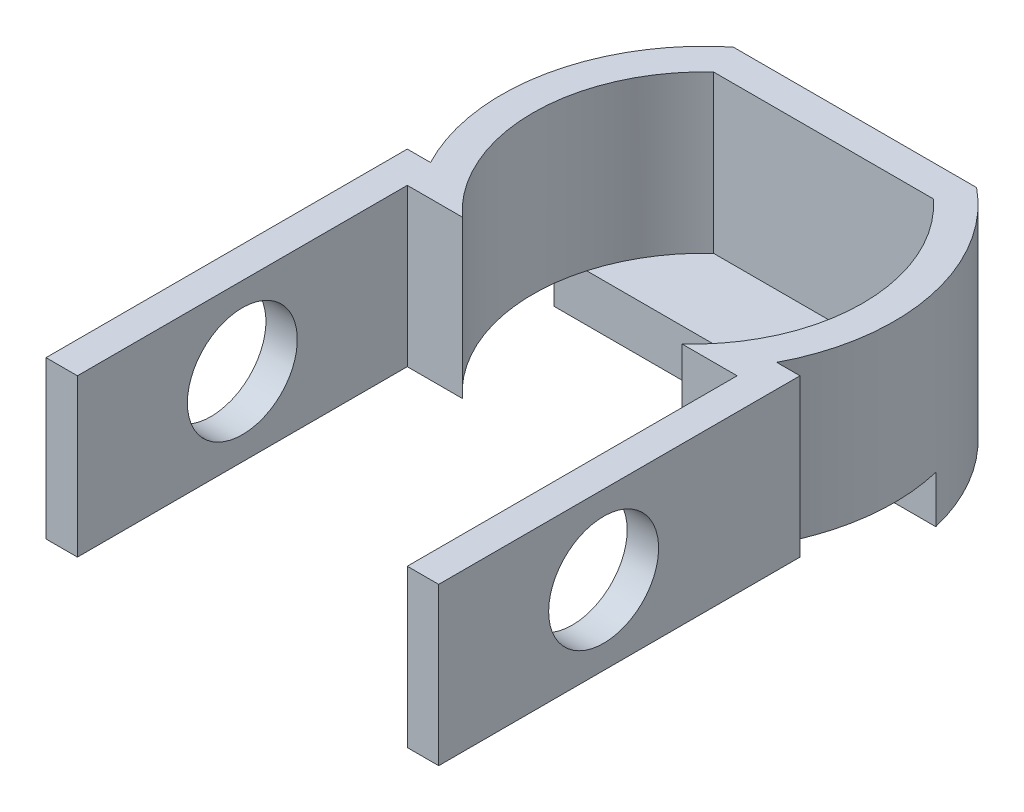
ISO-10303-21;
HEADER;
FILE_DESCRIPTION(('STEP AP214'),'2;1');
FILE_NAME('part.step','',(''),(''),'','','');
FILE_SCHEMA(('AUTOMOTIVE_DESIGN { 1 0 10303 214 1 1 1 1 }'));
ENDSEC;
DATA;
#1=APPLICATION_CONTEXT('core data for automotive mechanical design processes');
#2=APPLICATION_PROTOCOL_DEFINITION('international standard','automotive_design',2000,#1);
#3=PRODUCT_CONTEXT('',#1,'mechanical');
#4=PRODUCT('Part','Part','',(#3));
#5=PRODUCT_RELATED_PRODUCT_CATEGORY('part','',(#4));
#6=PRODUCT_DEFINITION_FORMATION('','',#4);
#7=PRODUCT_DEFINITION_CONTEXT('part definition',#1,'design');
#8=PRODUCT_DEFINITION('design','',#6,#7);
#9=PRODUCT_DEFINITION_SHAPE('','',#8);
#10=(LENGTH_UNIT() NAMED_UNIT(*) SI_UNIT(.MILLI.,.METRE.));
#11=(NAMED_UNIT(*) PLANE_ANGLE_UNIT() SI_UNIT($,.RADIAN.));
#12=(NAMED_UNIT(*) SI_UNIT($,.STERADIAN.) SOLID_ANGLE_UNIT());
#13=UNCERTAINTY_MEASURE_WITH_UNIT(LENGTH_MEASURE(1.E-05),#10,'distance_accuracy_value','');
#14=(GEOMETRIC_REPRESENTATION_CONTEXT(3) GLOBAL_UNCERTAINTY_ASSIGNED_CONTEXT((#13)) GLOBAL_UNIT_ASSIGNED_CONTEXT((#10,
#11,#12)) REPRESENTATION_CONTEXT('',''));
#15=CARTESIAN_POINT('',(0.,0.,0.));
#16=DIRECTION('',(0.,0.,1.));
#17=DIRECTION('',(1.,0.,0.));
#18=AXIS2_PLACEMENT_3D('',#15,#16,#17);
#19=CARTESIAN_POINT('',(0.392857142857146,0.,-8.));
#20=DIRECTION('',(0.,1.,0.));
#21=DIRECTION('',(0.,0.,1.));
#22=AXIS2_PLACEMENT_3D('',#19,#20,#21);
#23=PLANE('',#22);
#24=DIRECTION('',(-1.,0.,0.));
#25=VECTOR('',#24,1.);
#26=CARTESIAN_POINT('',(-12.1461127233688,0.,-11.));
#27=LINE('',#26,#25);
#28=CARTESIAN_POINT('',(12.1461127233688,0.,-11.));
#29=VERTEX_POINT('',#28);
#30=CARTESIAN_POINT('',(10.07873952311,0.,-11.));
#31=VERTEX_POINT('',#30);
#32=EDGE_CURVE('E57',#29,#31,#27,.T.);
#33=ORIENTED_EDGE('',*,*,#32,.F.);
#34=CARTESIAN_POINT('',(-0.392857142857146,0.,-8.));
#35=DIRECTION('',(0.,1.,0.));
#36=DIRECTION('',(0.,0.,-1.));
#37=AXIS2_PLACEMENT_3D('',#34,#35,#36);
#38=CIRCLE('',#37,12.8928571428571);
#39=CARTESIAN_POINT('',(11.0187932770481,0.,-2.));
#40=VERTEX_POINT('',#39);
#41=EDGE_CURVE('E311',#40,#29,#38,.T.);
#42=ORIENTED_EDGE('',*,*,#41,.F.);
#43=DIRECTION('',(-1.,0.,0.));
#44=VECTOR('',#43,1.);
#45=CARTESIAN_POINT('',(11.0187932770481,0.,-2.));
#46=LINE('',#45,#44);
#47=CARTESIAN_POINT('',(12.5,0.,-2.));
#48=VERTEX_POINT('',#47);
#49=EDGE_CURVE('E308',#48,#40,#46,.T.);
#50=ORIENTED_EDGE('',*,*,#49,.F.);
#51=DIRECTION('',(0.,0.,-1.));
#52=VECTOR('',#51,1.);
#53=CARTESIAN_POINT('',(12.5,0.,-2.));
#54=LINE('',#53,#52);
#55=CARTESIAN_POINT('',(12.5,0.,21.));
#56=VERTEX_POINT('',#55);
#57=EDGE_CURVE('E305',#56,#48,#54,.T.);
#58=ORIENTED_EDGE('',*,*,#57,.F.);
#59=DIRECTION('',(1.,0.,0.));
#60=VECTOR('',#59,1.);
#61=CARTESIAN_POINT('',(10.5,0.,21.));
#62=LINE('',#61,#60);
#63=CARTESIAN_POINT('',(10.5,0.,21.));
#64=VERTEX_POINT('',#63);
#65=EDGE_CURVE('E302',#64,#56,#62,.T.);
#66=ORIENTED_EDGE('',*,*,#65,.F.);
#67=DIRECTION('',(0.,0.,1.));
#68=VECTOR('',#67,1.);
#69=CARTESIAN_POINT('',(10.5,0.,0.));
#70=LINE('',#69,#68);
#71=CARTESIAN_POINT('',(10.5,0.,0.));
#72=VERTEX_POINT('',#71);
#73=EDGE_CURVE('E299',#72,#64,#70,.T.);
#74=ORIENTED_EDGE('',*,*,#73,.F.);
#75=DIRECTION('',(1.,0.,0.));
#76=VECTOR('',#75,1.);
#77=CARTESIAN_POINT('',(7.,0.,0.));
#78=LINE('',#77,#76);
#79=CARTESIAN_POINT('',(7.,0.,0.));
#80=VERTEX_POINT('',#79);
#81=EDGE_CURVE('E296',#80,#72,#78,.T.);
#82=ORIENTED_EDGE('',*,*,#81,.F.);
#83=CARTESIAN_POINT('',(-0.392857142857146,0.,-8.));
#84=DIRECTION('',(0.,-1.,0.));
#85=DIRECTION('',(0.,0.,-1.));
#86=AXIS2_PLACEMENT_3D('',#83,#84,#85);
#87=CIRCLE('',#86,10.8928571428571);
#88=EDGE_CURVE('E65',#31,#80,#87,.T.);
#89=ORIENTED_EDGE('',*,*,#88,.F.);
#90=EDGE_LOOP('',(#33,#42,#50,#58,#66,#74,#82,#89));
#91=FACE_BOUND('',#90,.T.);
#92=ADVANCED_FACE('F45',(#91),#23,.F.);
#93=CARTESIAN_POINT('',(-10.07873952311,0.,-11.));
#94=VERTEX_POINT('',#93);
#95=CARTESIAN_POINT('',(-12.1461127233688,0.,-11.));
#96=VERTEX_POINT('',#95);
#97=EDGE_CURVE('E11',#94,#96,#27,.T.);
#98=ORIENTED_EDGE('',*,*,#97,.F.);
#99=CARTESIAN_POINT('',(0.392857142857146,0.,-8.));
#100=DIRECTION('',(0.,-1.,0.));
#101=DIRECTION('',(0.,0.,1.));
#102=AXIS2_PLACEMENT_3D('',#99,#100,#101);
#103=CIRCLE('',#102,10.8928571428571);
#104=CARTESIAN_POINT('',(-7.,0.,0.));
#105=VERTEX_POINT('',#104);
#106=EDGE_CURVE('E286',#105,#94,#103,.T.);
#107=ORIENTED_EDGE('',*,*,#106,.F.);
#108=DIRECTION('',(1.,0.,0.));
#109=VECTOR('',#108,1.);
#110=CARTESIAN_POINT('',(-10.5,0.,0.));
#111=LINE('',#110,#109);
#112=CARTESIAN_POINT('',(-10.5,0.,0.));
#113=VERTEX_POINT('',#112);
#114=EDGE_CURVE('E241',#113,#105,#111,.T.);
#115=ORIENTED_EDGE('',*,*,#114,.F.);
#116=DIRECTION('',(0.,0.,-1.));
#117=VECTOR('',#116,1.);
#118=CARTESIAN_POINT('',(-10.5,0.,0.));
#119=LINE('',#118,#117);
#120=CARTESIAN_POINT('',(-10.5,0.,21.));
#121=VERTEX_POINT('',#120);
#122=EDGE_CURVE('E326',#121,#113,#119,.T.);
#123=ORIENTED_EDGE('',*,*,#122,.F.);
#124=DIRECTION('',(1.,0.,0.));
#125=VECTOR('',#124,1.);
#126=CARTESIAN_POINT('',(-12.5,0.,21.));
#127=LINE('',#126,#125);
#128=CARTESIAN_POINT('',(-12.5,0.,21.));
#129=VERTEX_POINT('',#128);
#130=EDGE_CURVE('E323',#129,#121,#127,.T.);
#131=ORIENTED_EDGE('',*,*,#130,.F.);
#132=DIRECTION('',(0.,0.,1.));
#133=VECTOR('',#132,1.);
#134=CARTESIAN_POINT('',(-12.5,0.,-2.));
#135=LINE('',#134,#133);
#136=CARTESIAN_POINT('',(-12.5,0.,-2.));
#137=VERTEX_POINT('',#136);
#138=EDGE_CURVE('E320',#137,#129,#135,.T.);
#139=ORIENTED_EDGE('',*,*,#138,.F.);
#140=DIRECTION('',(-1.,0.,0.));
#141=VECTOR('',#140,1.);
#142=CARTESIAN_POINT('',(-12.5,0.,-2.));
#143=LINE('',#142,#141);
#144=CARTESIAN_POINT('',(-11.0187932770481,0.,-2.));
#145=VERTEX_POINT('',#144);
#146=EDGE_CURVE('E317',#145,#137,#143,.T.);
#147=ORIENTED_EDGE('',*,*,#146,.F.);
#148=CARTESIAN_POINT('',(0.392857142857146,0.,-8.));
#149=DIRECTION('',(0.,1.,0.));
#150=DIRECTION('',(0.,0.,1.));
#151=AXIS2_PLACEMENT_3D('',#148,#149,#150);
#152=CIRCLE('',#151,12.8928571428571);
#153=EDGE_CURVE('E314',#96,#145,#152,.T.);
#154=ORIENTED_EDGE('',*,*,#153,.F.);
#155=EDGE_LOOP('',(#98,#107,#115,#123,#131,#139,#147,#154));
#156=FACE_BOUND('',#155,.T.);
#157=ADVANCED_FACE('F411',(#156),#23,.F.);
#158=CARTESIAN_POINT('',(0.392857142857146,10.,-8.));
#159=DIRECTION('',(0.,-1.,0.));
#160=DIRECTION('',(0.,0.,-1.));
#161=AXIS2_PLACEMENT_3D('',#158,#159,#160);
#162=CYLINDRICAL_SURFACE('',#161,10.8928571428571);
#163=ORIENTED_EDGE('',*,*,#106,.T.);
#164=CARTESIAN_POINT('',(-7.,0.,-16.));
#165=VERTEX_POINT('',#164);
#166=EDGE_CURVE('E235',#94,#165,#103,.T.);
#167=ORIENTED_EDGE('',*,*,#166,.T.);
#168=DIRECTION('',(0.,-1.,0.));
#169=VECTOR('',#168,1.);
#170=CARTESIAN_POINT('',(-7.,10.,-16.));
#171=LINE('',#170,#169);
#172=CARTESIAN_POINT('',(-7.,10.,-16.));
#173=VERTEX_POINT('',#172);
#174=EDGE_CURVE('E55',#173,#165,#171,.T.);
#175=ORIENTED_EDGE('',*,*,#174,.F.);
#176=CARTESIAN_POINT('',(0.392857142857146,10.,-8.));
#177=DIRECTION('',(0.,-1.,0.));
#178=DIRECTION('',(0.,0.,1.));
#179=AXIS2_PLACEMENT_3D('',#176,#177,#178);
#180=CIRCLE('',#179,10.8928571428571);
#181=CARTESIAN_POINT('',(-7.,10.,0.));
#182=VERTEX_POINT('',#181);
#183=EDGE_CURVE('E236',#182,#173,#180,.T.);
#184=ORIENTED_EDGE('',*,*,#183,.F.);
#185=DIRECTION('',(0.,-1.,0.));
#186=VECTOR('',#185,1.);
#187=CARTESIAN_POINT('',(-7.,10.,0.));
#188=LINE('',#187,#186);
#189=EDGE_CURVE('E285',#182,#105,#188,.T.);
#190=ORIENTED_EDGE('',*,*,#189,.T.);
#191=EDGE_LOOP('',(#163,#167,#175,#184,#190));
#192=FACE_BOUND('',#191,.T.);
#193=ADVANCED_FACE('F47',(#192),#162,.F.);
#194=CARTESIAN_POINT('',(7.,10.,-16.));
#195=DIRECTION('',(0.,0.,-1.));
#196=DIRECTION('',(-1.,0.,0.));
#197=AXIS2_PLACEMENT_3D('',#194,#195,#196);
#198=PLANE('',#197);
#199=DIRECTION('',(1.,0.,0.));
#200=VECTOR('',#199,1.);
#201=CARTESIAN_POINT('',(7.,0.,-16.));
#202=LINE('',#201,#200);
#203=CARTESIAN_POINT('',(7.,0.,-16.));
#204=VERTEX_POINT('',#203);
#205=EDGE_CURVE('E290',#165,#204,#202,.T.);
#206=ORIENTED_EDGE('',*,*,#205,.T.);
#207=DIRECTION('',(0.,-1.,0.));
#208=VECTOR('',#207,1.);
#209=CARTESIAN_POINT('',(7.,10.,-16.));
#210=LINE('',#209,#208);
#211=CARTESIAN_POINT('',(7.,10.,-16.));
#212=VERTEX_POINT('',#211);
#213=EDGE_CURVE('E379',#212,#204,#210,.T.);
#214=ORIENTED_EDGE('',*,*,#213,.F.);
#215=DIRECTION('',(1.,0.,0.));
#216=VECTOR('',#215,1.);
#217=CARTESIAN_POINT('',(7.,10.,-16.));
#218=LINE('',#217,#216);
#219=EDGE_CURVE('E240',#173,#212,#218,.T.);
#220=ORIENTED_EDGE('',*,*,#219,.F.);
#221=ORIENTED_EDGE('',*,*,#174,.T.);
#222=EDGE_LOOP('',(#206,#214,#220,#221));
#223=FACE_BOUND('',#222,.T.);
#224=ADVANCED_FACE('F387',(#223),#198,.F.);
#225=CARTESIAN_POINT('',(-0.392857142857146,10.,-8.));
#226=DIRECTION('',(0.,-1.,0.));
#227=DIRECTION('',(0.,0.,-1.));
#228=AXIS2_PLACEMENT_3D('',#225,#226,#227);
#229=CYLINDRICAL_SURFACE('',#228,10.8928571428571);
#230=EDGE_CURVE('E293',#204,#31,#87,.T.);
#231=ORIENTED_EDGE('',*,*,#230,.T.);
#232=ORIENTED_EDGE('',*,*,#88,.T.);
#233=DIRECTION('',(0.,-1.,0.));
#234=VECTOR('',#233,1.);
#235=CARTESIAN_POINT('',(7.,10.,0.));
#236=LINE('',#235,#234);
#237=CARTESIAN_POINT('',(7.,10.,0.));
#238=VERTEX_POINT('',#237);
#239=EDGE_CURVE('E375',#238,#80,#236,.T.);
#240=ORIENTED_EDGE('',*,*,#239,.F.);
#241=CARTESIAN_POINT('',(-0.392857142857146,10.,-8.));
#242=DIRECTION('',(0.,-1.,0.));
#243=DIRECTION('',(0.,0.,-1.));
#244=AXIS2_PLACEMENT_3D('',#241,#242,#243);
#245=CIRCLE('',#244,10.8928571428571);
#246=EDGE_CURVE('E244',#212,#238,#245,.T.);
#247=ORIENTED_EDGE('',*,*,#246,.F.);
#248=ORIENTED_EDGE('',*,*,#213,.T.);
#249=EDGE_LOOP('',(#231,#232,#240,#247,#248));
#250=FACE_BOUND('',#249,.T.);
#251=ADVANCED_FACE('F398',(#250),#229,.F.);
#252=CARTESIAN_POINT('',(7.,10.,0.));
#253=DIRECTION('',(0.,0.,-1.));
#254=DIRECTION('',(-1.,0.,0.));
#255=AXIS2_PLACEMENT_3D('',#252,#253,#254);
#256=PLANE('',#255);
#257=ORIENTED_EDGE('',*,*,#81,.T.);
#258=DIRECTION('',(0.,-1.,0.));
#259=VECTOR('',#258,1.);
#260=CARTESIAN_POINT('',(10.5,10.,0.));
#261=LINE('',#260,#259);
#262=CARTESIAN_POINT('',(10.5,10.,0.));
#263=VERTEX_POINT('',#262);
#264=EDGE_CURVE('E371',#263,#72,#261,.T.);
#265=ORIENTED_EDGE('',*,*,#264,.F.);
#266=DIRECTION('',(1.,0.,0.));
#267=VECTOR('',#266,1.);
#268=CARTESIAN_POINT('',(7.,10.,0.));
#269=LINE('',#268,#267);
#270=EDGE_CURVE('E247',#238,#263,#269,.T.);
#271=ORIENTED_EDGE('',*,*,#270,.F.);
#272=ORIENTED_EDGE('',*,*,#239,.T.);
#273=EDGE_LOOP('',(#257,#265,#271,#272));
#274=FACE_BOUND('',#273,.T.);
#275=ADVANCED_FACE('F457',(#274),#256,.F.);
#276=CARTESIAN_POINT('',(10.5,10.,0.));
#277=DIRECTION('',(1.,0.,0.));
#278=DIRECTION('',(0.,0.,-1.));
#279=AXIS2_PLACEMENT_3D('',#276,#277,#278);
#280=PLANE('',#279);
#281=CARTESIAN_POINT('',(10.5,5.,10.5));
#282=DIRECTION('',(1.,0.,0.));
#283=DIRECTION('',(0.,0.,-1.));
#284=AXIS2_PLACEMENT_3D('',#281,#282,#283);
#285=CIRCLE('',#284,3.5);
#286=CARTESIAN_POINT('',(10.5,5.,7.));
#287=VERTEX_POINT('',#286);
#288=EDGE_CURVE('E231',#287,#287,#285,.T.);
#289=ORIENTED_EDGE('',*,*,#288,.T.);
#290=EDGE_LOOP('',(#289));
#291=FACE_BOUND('',#290,.T.);
#292=ORIENTED_EDGE('',*,*,#73,.T.);
#293=DIRECTION('',(0.,-1.,0.));
#294=VECTOR('',#293,1.);
#295=CARTESIAN_POINT('',(10.5,10.,21.));
#296=LINE('',#295,#294);
#297=CARTESIAN_POINT('',(10.5,10.,21.));
#298=VERTEX_POINT('',#297);
#299=EDGE_CURVE('E367',#298,#64,#296,.T.);
#300=ORIENTED_EDGE('',*,*,#299,.F.);
#301=DIRECTION('',(0.,0.,1.));
#302=VECTOR('',#301,1.);
#303=CARTESIAN_POINT('',(10.5,10.,0.));
#304=LINE('',#303,#302);
#305=EDGE_CURVE('E250',#263,#298,#304,.T.);
#306=ORIENTED_EDGE('',*,*,#305,.F.);
#307=ORIENTED_EDGE('',*,*,#264,.T.);
#308=EDGE_LOOP('',(#292,#300,#306,#307));
#309=FACE_BOUND('',#308,.T.);
#310=ADVANCED_FACE('F454',(#291,#309),#280,.F.);
#311=CARTESIAN_POINT('',(10.5,10.,21.));
#312=DIRECTION('',(0.,0.,-1.));
#313=DIRECTION('',(-1.,0.,0.));
#314=AXIS2_PLACEMENT_3D('',#311,#312,#313);
#315=PLANE('',#314);
#316=ORIENTED_EDGE('',*,*,#65,.T.);
#317=DIRECTION('',(0.,-1.,0.));
#318=VECTOR('',#317,1.);
#319=CARTESIAN_POINT('',(12.5,10.,21.));
#320=LINE('',#319,#318);
#321=CARTESIAN_POINT('',(12.5,10.,21.));
#322=VERTEX_POINT('',#321);
#323=EDGE_CURVE('E363',#322,#56,#320,.T.);
#324=ORIENTED_EDGE('',*,*,#323,.F.);
#325=DIRECTION('',(1.,0.,0.));
#326=VECTOR('',#325,1.);
#327=CARTESIAN_POINT('',(10.5,10.,21.));
#328=LINE('',#327,#326);
#329=EDGE_CURVE('E253',#298,#322,#328,.T.);
#330=ORIENTED_EDGE('',*,*,#329,.F.);
#331=ORIENTED_EDGE('',*,*,#299,.T.);
#332=EDGE_LOOP('',(#316,#324,#330,#331));
#333=FACE_BOUND('',#332,.T.);
#334=ADVANCED_FACE('F450',(#333),#315,.F.);
#335=CARTESIAN_POINT('',(12.5,10.,-2.));
#336=DIRECTION('',(-1.,0.,0.));
#337=DIRECTION('',(0.,0.,1.));
#338=AXIS2_PLACEMENT_3D('',#335,#336,#337);
#339=PLANE('',#338);
#340=CARTESIAN_POINT('',(12.5,5.,10.5));
#341=DIRECTION('',(-1.,0.,0.));
#342=DIRECTION('',(0.,0.,1.));
#343=AXIS2_PLACEMENT_3D('',#340,#341,#342);
#344=CIRCLE('',#343,3.5);
#345=CARTESIAN_POINT('',(12.5,5.,14.));
#346=VERTEX_POINT('',#345);
#347=EDGE_CURVE('E224',#346,#346,#344,.T.);
#348=ORIENTED_EDGE('',*,*,#347,.T.);
#349=EDGE_LOOP('',(#348));
#350=FACE_BOUND('',#349,.T.);
#351=ORIENTED_EDGE('',*,*,#57,.T.);
#352=DIRECTION('',(0.,-1.,0.));
#353=VECTOR('',#352,1.);
#354=CARTESIAN_POINT('',(12.5,10.,-2.));
#355=LINE('',#354,#353);
#356=CARTESIAN_POINT('',(12.5,10.,-2.));
#357=VERTEX_POINT('',#356);
#358=EDGE_CURVE('E359',#357,#48,#355,.T.);
#359=ORIENTED_EDGE('',*,*,#358,.F.);
#360=DIRECTION('',(0.,0.,-1.));
#361=VECTOR('',#360,1.);
#362=CARTESIAN_POINT('',(12.5,10.,-2.));
#363=LINE('',#362,#361);
#364=EDGE_CURVE('E256',#322,#357,#363,.T.);
#365=ORIENTED_EDGE('',*,*,#364,.F.);
#366=ORIENTED_EDGE('',*,*,#323,.T.);
#367=EDGE_LOOP('',(#351,#359,#365,#366));
#368=FACE_BOUND('',#367,.T.);
#369=ADVANCED_FACE('F446',(#350,#368),#339,.F.);
#370=CARTESIAN_POINT('',(11.0187932770481,10.,-2.));
#371=DIRECTION('',(0.,0.,1.));
#372=DIRECTION('',(1.,0.,0.));
#373=AXIS2_PLACEMENT_3D('',#370,#371,#372);
#374=PLANE('',#373);
#375=ORIENTED_EDGE('',*,*,#49,.T.);
#376=DIRECTION('',(0.,-1.,0.));
#377=VECTOR('',#376,1.);
#378=CARTESIAN_POINT('',(11.0187932770481,10.,-2.));
#379=LINE('',#378,#377);
#380=CARTESIAN_POINT('',(11.0187932770481,10.,-2.));
#381=VERTEX_POINT('',#380);
#382=EDGE_CURVE('E355',#381,#40,#379,.T.);
#383=ORIENTED_EDGE('',*,*,#382,.F.);
#384=DIRECTION('',(-1.,0.,0.));
#385=VECTOR('',#384,1.);
#386=CARTESIAN_POINT('',(11.0187932770481,10.,-2.));
#387=LINE('',#386,#385);
#388=EDGE_CURVE('E259',#357,#381,#387,.T.);
#389=ORIENTED_EDGE('',*,*,#388,.F.);
#390=ORIENTED_EDGE('',*,*,#358,.T.);
#391=EDGE_LOOP('',(#375,#383,#389,#390));
#392=FACE_BOUND('',#391,.T.);
#393=ADVANCED_FACE('F442',(#392),#374,.F.);
#394=CARTESIAN_POINT('',(-0.392857142857146,10.,-8.));
#395=DIRECTION('',(0.,-1.,0.));
#396=DIRECTION('',(0.,0.,-1.));
#397=AXIS2_PLACEMENT_3D('',#394,#395,#396);
#398=CYLINDRICAL_SURFACE('',#397,12.8928571428571);
#399=ORIENTED_EDGE('',*,*,#41,.T.);
#400=DIRECTION('',(0.,1.,0.));
#401=VECTOR('',#400,1.);
#402=CARTESIAN_POINT('',(12.1461127233688,-3.,-11.));
#403=LINE('',#402,#401);
#404=CARTESIAN_POINT('',(12.1461127233688,-3.,-11.));
#405=VERTEX_POINT('',#404);
#406=EDGE_CURVE('E219',#405,#29,#403,.T.);
#407=ORIENTED_EDGE('',*,*,#406,.F.);
#408=CARTESIAN_POINT('',(-0.392857142857122,-3.,-8.00000000000002));
#409=DIRECTION('',(0.,-1.,0.));
#410=DIRECTION('',(0.,0.,-1.));
#411=AXIS2_PLACEMENT_3D('',#408,#409,#410);
#412=CIRCLE('',#411,12.8928571428571);
#413=CARTESIAN_POINT('',(7.74506429361068,-3.,-18.));
#414=VERTEX_POINT('',#413);
#415=EDGE_CURVE('E202',#414,#405,#412,.T.);
#416=ORIENTED_EDGE('',*,*,#415,.F.);
#417=DIRECTION('',(0.,-1.,0.));
#418=VECTOR('',#417,1.);
#419=CARTESIAN_POINT('',(7.74506429361068,10.,-18.));
#420=LINE('',#419,#418);
#421=CARTESIAN_POINT('',(7.74506429361068,10.,-18.));
#422=VERTEX_POINT('',#421);
#423=EDGE_CURVE('E192',#422,#414,#420,.T.);
#424=ORIENTED_EDGE('',*,*,#423,.F.);
#425=CARTESIAN_POINT('',(-0.392857142857146,10.,-8.));
#426=DIRECTION('',(0.,1.,0.));
#427=DIRECTION('',(0.,0.,-1.));
#428=AXIS2_PLACEMENT_3D('',#425,#426,#427);
#429=CIRCLE('',#428,12.8928571428571);
#430=EDGE_CURVE('E262',#381,#422,#429,.T.);
#431=ORIENTED_EDGE('',*,*,#430,.F.);
#432=ORIENTED_EDGE('',*,*,#382,.T.);
#433=EDGE_LOOP('',(#399,#407,#416,#424,#431,#432));
#434=FACE_BOUND('',#433,.T.);
#435=ADVANCED_FACE('F436',(#434),#398,.T.);
#436=CARTESIAN_POINT('',(7.74506429361068,10.,-18.));
#437=DIRECTION('',(0.,0.,1.));
#438=DIRECTION('',(1.,0.,0.));
#439=AXIS2_PLACEMENT_3D('',#436,#437,#438);
#440=PLANE('',#439);
#441=ORIENTED_EDGE('',*,*,#423,.T.);
#442=DIRECTION('',(1.,0.,0.));
#443=VECTOR('',#442,1.);
#444=CARTESIAN_POINT('',(7.74506429361068,-3.,-18.));
#445=LINE('',#444,#443);
#446=CARTESIAN_POINT('',(-7.74506429361067,-3.,-18.));
#447=VERTEX_POINT('',#446);
#448=EDGE_CURVE('E196',#447,#414,#445,.T.);
#449=ORIENTED_EDGE('',*,*,#448,.F.);
#450=DIRECTION('',(0.,-1.,0.));
#451=VECTOR('',#450,1.);
#452=CARTESIAN_POINT('',(-7.74506429361067,10.,-18.));
#453=LINE('',#452,#451);
#454=CARTESIAN_POINT('',(-7.74506429361067,10.,-18.));
#455=VERTEX_POINT('',#454);
#456=EDGE_CURVE('E181',#455,#447,#453,.T.);
#457=ORIENTED_EDGE('',*,*,#456,.F.);
#458=DIRECTION('',(-1.,0.,0.));
#459=VECTOR('',#458,1.);
#460=CARTESIAN_POINT('',(7.74506429361068,10.,-18.));
#461=LINE('',#460,#459);
#462=EDGE_CURVE('E265',#422,#455,#461,.T.);
#463=ORIENTED_EDGE('',*,*,#462,.F.);
#464=EDGE_LOOP('',(#441,#449,#457,#463));
#465=FACE_BOUND('',#464,.T.);
#466=ADVANCED_FACE('F197',(#465),#440,.F.);
#467=CARTESIAN_POINT('',(0.392857142857146,10.,-8.));
#468=DIRECTION('',(0.,-1.,0.));
#469=DIRECTION('',(0.,0.,-1.));
#470=AXIS2_PLACEMENT_3D('',#467,#468,#469);
#471=CYLINDRICAL_SURFACE('',#470,12.8928571428571);
#472=ORIENTED_EDGE('',*,*,#456,.T.);
#473=CARTESIAN_POINT('',(0.392857142857252,-3.,-7.99999999999993));
#474=DIRECTION('',(0.,-1.,0.));
#475=DIRECTION('',(0.,0.,-1.));
#476=AXIS2_PLACEMENT_3D('',#473,#474,#475);
#477=CIRCLE('',#476,12.8928571428573);
#478=CARTESIAN_POINT('',(-12.1461127233688,-3.,-11.));
#479=VERTEX_POINT('',#478);
#480=EDGE_CURVE('E186',#479,#447,#477,.T.);
#481=ORIENTED_EDGE('',*,*,#480,.F.);
#482=DIRECTION('',(0.,1.,0.));
#483=VECTOR('',#482,1.);
#484=CARTESIAN_POINT('',(-12.1461127233688,-3.,-11.));
#485=LINE('',#484,#483);
#486=EDGE_CURVE('E215',#479,#96,#485,.T.);
#487=ORIENTED_EDGE('',*,*,#486,.T.);
#488=ORIENTED_EDGE('',*,*,#153,.T.);
#489=DIRECTION('',(0.,-1.,0.));
#490=VECTOR('',#489,1.);
#491=CARTESIAN_POINT('',(-11.0187932770481,10.,-2.));
#492=LINE('',#491,#490);
#493=CARTESIAN_POINT('',(-11.0187932770481,10.,-2.));
#494=VERTEX_POINT('',#493);
#495=EDGE_CURVE('E193',#494,#145,#492,.T.);
#496=ORIENTED_EDGE('',*,*,#495,.F.);
#497=CARTESIAN_POINT('',(0.392857142857146,10.,-8.));
#498=DIRECTION('',(0.,1.,0.));
#499=DIRECTION('',(0.,0.,1.));
#500=AXIS2_PLACEMENT_3D('',#497,#498,#499);
#501=CIRCLE('',#500,12.8928571428571);
#502=EDGE_CURVE('E188',#455,#494,#501,.T.);
#503=ORIENTED_EDGE('',*,*,#502,.F.);
#504=EDGE_LOOP('',(#472,#481,#487,#488,#496,#503));
#505=FACE_BOUND('',#504,.T.);
#506=ADVANCED_FACE('F183',(#505),#471,.T.);
#507=CARTESIAN_POINT('',(-12.5,10.,-2.));
#508=DIRECTION('',(0.,0.,1.));
#509=DIRECTION('',(1.,0.,0.));
#510=AXIS2_PLACEMENT_3D('',#507,#508,#509);
#511=PLANE('',#510);
#512=ORIENTED_EDGE('',*,*,#146,.T.);
#513=DIRECTION('',(0.,-1.,0.));
#514=VECTOR('',#513,1.);
#515=CARTESIAN_POINT('',(-12.5,10.,-2.));
#516=LINE('',#515,#514);
#517=CARTESIAN_POINT('',(-12.5,10.,-2.));
#518=VERTEX_POINT('',#517);
#519=EDGE_CURVE('E346',#518,#137,#516,.T.);
#520=ORIENTED_EDGE('',*,*,#519,.F.);
#521=DIRECTION('',(-1.,0.,0.));
#522=VECTOR('',#521,1.);
#523=CARTESIAN_POINT('',(-12.5,10.,-2.));
#524=LINE('',#523,#522);
#525=EDGE_CURVE('E270',#494,#518,#524,.T.);
#526=ORIENTED_EDGE('',*,*,#525,.F.);
#527=ORIENTED_EDGE('',*,*,#495,.T.);
#528=EDGE_LOOP('',(#512,#520,#526,#527));
#529=FACE_BOUND('',#528,.T.);
#530=ADVANCED_FACE('F418',(#529),#511,.F.);
#531=CARTESIAN_POINT('',(-12.5,10.,-2.));
#532=DIRECTION('',(1.,0.,0.));
#533=DIRECTION('',(0.,0.,-1.));
#534=AXIS2_PLACEMENT_3D('',#531,#532,#533);
#535=PLANE('',#534);
#536=CARTESIAN_POINT('',(-12.5,5.,10.5));
#537=DIRECTION('',(-1.,0.,0.));
#538=DIRECTION('',(0.,0.,1.));
#539=AXIS2_PLACEMENT_3D('',#536,#537,#538);
#540=CIRCLE('',#539,3.5);
#541=CARTESIAN_POINT('',(-12.5,5.,14.));
#542=VERTEX_POINT('',#541);
#543=EDGE_CURVE('E223',#542,#542,#540,.T.);
#544=ORIENTED_EDGE('',*,*,#543,.F.);
#545=EDGE_LOOP('',(#544));
#546=FACE_BOUND('',#545,.T.);
#547=ORIENTED_EDGE('',*,*,#138,.T.);
#548=DIRECTION('',(0.,-1.,0.));
#549=VECTOR('',#548,1.);
#550=CARTESIAN_POINT('',(-12.5,10.,21.));
#551=LINE('',#550,#549);
#552=CARTESIAN_POINT('',(-12.5,10.,21.));
#553=VERTEX_POINT('',#552);
#554=EDGE_CURVE('E342',#553,#129,#551,.T.);
#555=ORIENTED_EDGE('',*,*,#554,.F.);
#556=DIRECTION('',(0.,0.,1.));
#557=VECTOR('',#556,1.);
#558=CARTESIAN_POINT('',(-12.5,10.,-2.));
#559=LINE('',#558,#557);
#560=EDGE_CURVE('E273',#518,#553,#559,.T.);
#561=ORIENTED_EDGE('',*,*,#560,.F.);
#562=ORIENTED_EDGE('',*,*,#519,.T.);
#563=EDGE_LOOP('',(#547,#555,#561,#562));
#564=FACE_BOUND('',#563,.T.);
#565=ADVANCED_FACE('F424',(#546,#564),#535,.F.);
#566=CARTESIAN_POINT('',(-12.5,10.,21.));
#567=DIRECTION('',(0.,0.,-1.));
#568=DIRECTION('',(-1.,0.,0.));
#569=AXIS2_PLACEMENT_3D('',#566,#567,#568);
#570=PLANE('',#569);
#571=ORIENTED_EDGE('',*,*,#130,.T.);
#572=DIRECTION('',(0.,-1.,0.));
#573=VECTOR('',#572,1.);
#574=CARTESIAN_POINT('',(-10.5,10.,21.));
#575=LINE('',#574,#573);
#576=CARTESIAN_POINT('',(-10.5,10.,21.));
#577=VERTEX_POINT('',#576);
#578=EDGE_CURVE('E338',#577,#121,#575,.T.);
#579=ORIENTED_EDGE('',*,*,#578,.F.);
#580=DIRECTION('',(1.,0.,0.));
#581=VECTOR('',#580,1.);
#582=CARTESIAN_POINT('',(-12.5,10.,21.));
#583=LINE('',#582,#581);
#584=EDGE_CURVE('E276',#553,#577,#583,.T.);
#585=ORIENTED_EDGE('',*,*,#584,.F.);
#586=ORIENTED_EDGE('',*,*,#554,.T.);
#587=EDGE_LOOP('',(#571,#579,#585,#586));
#588=FACE_BOUND('',#587,.T.);
#589=ADVANCED_FACE('F428',(#588),#570,.F.);
#590=CARTESIAN_POINT('',(-10.5,10.,0.));
#591=DIRECTION('',(-1.,0.,0.));
#592=DIRECTION('',(0.,0.,1.));
#593=AXIS2_PLACEMENT_3D('',#590,#591,#592);
#594=PLANE('',#593);
#595=CARTESIAN_POINT('',(-10.5,5.,10.5));
#596=DIRECTION('',(-1.,0.,0.));
#597=DIRECTION('',(0.,0.,1.));
#598=AXIS2_PLACEMENT_3D('',#595,#596,#597);
#599=CIRCLE('',#598,3.5);
#600=CARTESIAN_POINT('',(-10.5,5.,14.));
#601=VERTEX_POINT('',#600);
#602=EDGE_CURVE('E49',#601,#601,#599,.T.);
#603=ORIENTED_EDGE('',*,*,#602,.T.);
#604=EDGE_LOOP('',(#603));
#605=FACE_BOUND('',#604,.T.);
#606=ORIENTED_EDGE('',*,*,#122,.T.);
#607=DIRECTION('',(0.,-1.,0.));
#608=VECTOR('',#607,1.);
#609=CARTESIAN_POINT('',(-10.5,10.,0.));
#610=LINE('',#609,#608);
#611=CARTESIAN_POINT('',(-10.5,10.,0.));
#612=VERTEX_POINT('',#611);
#613=EDGE_CURVE('E334',#612,#113,#610,.T.);
#614=ORIENTED_EDGE('',*,*,#613,.F.);
#615=DIRECTION('',(0.,0.,-1.));
#616=VECTOR('',#615,1.);
#617=CARTESIAN_POINT('',(-10.5,10.,0.));
#618=LINE('',#617,#616);
#619=EDGE_CURVE('E279',#577,#612,#618,.T.);
#620=ORIENTED_EDGE('',*,*,#619,.F.);
#621=ORIENTED_EDGE('',*,*,#578,.T.);
#622=EDGE_LOOP('',(#606,#614,#620,#621));
#623=FACE_BOUND('',#622,.T.);
#624=ADVANCED_FACE('F480',(#605,#623),#594,.F.);
#625=CARTESIAN_POINT('',(-10.5,10.,0.));
#626=DIRECTION('',(0.,0.,-1.));
#627=DIRECTION('',(-1.,0.,0.));
#628=AXIS2_PLACEMENT_3D('',#625,#626,#627);
#629=PLANE('',#628);
#630=ORIENTED_EDGE('',*,*,#114,.T.);
#631=ORIENTED_EDGE('',*,*,#189,.F.);
#632=DIRECTION('',(1.,0.,0.));
#633=VECTOR('',#632,1.);
#634=CARTESIAN_POINT('',(-10.5,10.,0.));
#635=LINE('',#634,#633);
#636=EDGE_CURVE('E282',#612,#182,#635,.T.);
#637=ORIENTED_EDGE('',*,*,#636,.F.);
#638=ORIENTED_EDGE('',*,*,#613,.T.);
#639=EDGE_LOOP('',(#630,#631,#637,#638));
#640=FACE_BOUND('',#639,.T.);
#641=ADVANCED_FACE('F477',(#640),#629,.F.);
#642=CARTESIAN_POINT('',(0.392857142857146,10.,-8.));
#643=DIRECTION('',(0.,1.,0.));
#644=DIRECTION('',(0.,0.,1.));
#645=AXIS2_PLACEMENT_3D('',#642,#643,#644);
#646=PLANE('',#645);
#647=ORIENTED_EDGE('',*,*,#183,.T.);
#648=ORIENTED_EDGE('',*,*,#219,.T.);
#649=ORIENTED_EDGE('',*,*,#246,.T.);
#650=ORIENTED_EDGE('',*,*,#270,.T.);
#651=ORIENTED_EDGE('',*,*,#305,.T.);
#652=ORIENTED_EDGE('',*,*,#329,.T.);
#653=ORIENTED_EDGE('',*,*,#364,.T.);
#654=ORIENTED_EDGE('',*,*,#388,.T.);
#655=ORIENTED_EDGE('',*,*,#430,.T.);
#656=ORIENTED_EDGE('',*,*,#462,.T.);
#657=ORIENTED_EDGE('',*,*,#502,.T.);
#658=ORIENTED_EDGE('',*,*,#525,.T.);
#659=ORIENTED_EDGE('',*,*,#560,.T.);
#660=ORIENTED_EDGE('',*,*,#584,.T.);
#661=ORIENTED_EDGE('',*,*,#619,.T.);
#662=ORIENTED_EDGE('',*,*,#636,.T.);
#663=EDGE_LOOP('',(#647,#648,#649,#650,#651,#652,#653,#654,#655,#656,#657,#658,#659,#660,#661,#662));
#664=FACE_BOUND('',#663,.T.);
#665=ADVANCED_FACE('F403',(#664),#646,.T.);
#666=CARTESIAN_POINT('',(12.5,5.,10.5));
#667=DIRECTION('',(-1.,0.,0.));
#668=DIRECTION('',(0.,0.,1.));
#669=AXIS2_PLACEMENT_3D('',#666,#667,#668);
#670=CYLINDRICAL_SURFACE('',#669,3.5);
#671=ORIENTED_EDGE('',*,*,#543,.T.);
#672=EDGE_LOOP('',(#671));
#673=FACE_BOUND('',#672,.T.);
#674=ORIENTED_EDGE('',*,*,#602,.F.);
#675=EDGE_LOOP('',(#674));
#676=FACE_BOUND('',#675,.T.);
#677=ADVANCED_FACE('F536',(#673,#676),#670,.F.);
#678=ORIENTED_EDGE('',*,*,#347,.F.);
#679=EDGE_LOOP('',(#678));
#680=FACE_BOUND('',#679,.T.);
#681=ORIENTED_EDGE('',*,*,#288,.F.);
#682=EDGE_LOOP('',(#681));
#683=FACE_BOUND('',#682,.T.);
#684=ADVANCED_FACE('F559',(#680,#683),#670,.F.);
#685=CARTESIAN_POINT('',(-12.1461127233688,-3.,-11.));
#686=DIRECTION('',(0.,0.,-1.));
#687=DIRECTION('',(-1.,0.,0.));
#688=AXIS2_PLACEMENT_3D('',#685,#686,#687);
#689=PLANE('',#688);
#690=ORIENTED_EDGE('',*,*,#32,.T.);
#691=EDGE_CURVE('E58',#31,#94,#27,.T.);
#692=ORIENTED_EDGE('',*,*,#691,.T.);
#693=ORIENTED_EDGE('',*,*,#97,.T.);
#694=ORIENTED_EDGE('',*,*,#486,.F.);
#695=DIRECTION('',(-1.,0.,0.));
#696=VECTOR('',#695,1.);
#697=CARTESIAN_POINT('',(-12.1461127233688,-3.,-11.));
#698=LINE('',#697,#696);
#699=EDGE_CURVE('E206',#405,#479,#698,.T.);
#700=ORIENTED_EDGE('',*,*,#699,.F.);
#701=ORIENTED_EDGE('',*,*,#406,.T.);
#702=EDGE_LOOP('',(#690,#692,#693,#694,#700,#701));
#703=FACE_BOUND('',#702,.T.);
#704=ADVANCED_FACE('F415',(#703),#689,.F.);
#705=CARTESIAN_POINT('',(0.392857142857252,-3.,-7.99999999999993));
#706=DIRECTION('',(0.,-1.,0.));
#707=DIRECTION('',(0.,0.,-1.));
#708=AXIS2_PLACEMENT_3D('',#705,#706,#707);
#709=PLANE('',#708);
#710=ORIENTED_EDGE('',*,*,#480,.T.);
#711=ORIENTED_EDGE('',*,*,#448,.T.);
#712=ORIENTED_EDGE('',*,*,#415,.T.);
#713=ORIENTED_EDGE('',*,*,#699,.T.);
#714=EDGE_LOOP('',(#710,#711,#712,#713));
#715=FACE_BOUND('',#714,.T.);
#716=ADVANCED_FACE('F204',(#715),#709,.T.);
#717=CARTESIAN_POINT('',(0.392857142857252,0.,-7.99999999999993));
#718=DIRECTION('',(0.,-1.,0.));
#719=DIRECTION('',(0.,0.,-1.));
#720=AXIS2_PLACEMENT_3D('',#717,#718,#719);
#721=PLANE('',#720);
#722=ORIENTED_EDGE('',*,*,#166,.F.);
#723=ORIENTED_EDGE('',*,*,#691,.F.);
#724=ORIENTED_EDGE('',*,*,#230,.F.);
#725=ORIENTED_EDGE('',*,*,#205,.F.);
#726=EDGE_LOOP('',(#722,#723,#724,#725));
#727=FACE_BOUND('',#726,.T.);
#728=ADVANCED_FACE('F394',(#727),#721,.F.);
#729=CLOSED_SHELL('',(#92,#157,#193,#224,#251,#275,#310,#334,#369,#393,#435,#466,#506,#530,#565,
#589,#624,#641,#665,#677,#684,#704,#716,#728));
#730=MANIFOLD_SOLID_BREP('B2',#729);
#731=ADVANCED_BREP_SHAPE_REPRESENTATION('',(#18,#730),#14);
#732=SHAPE_DEFINITION_REPRESENTATION(#9,#731);
ENDSEC;
END-ISO-10303-21;
